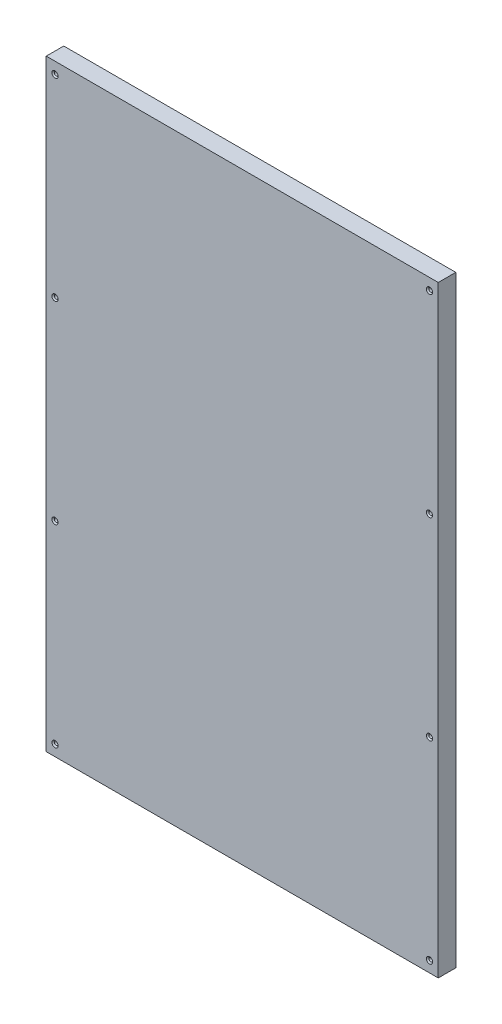
ISO-10303-21;
HEADER;
FILE_DESCRIPTION(('STEP AP214'),'2;1');
FILE_NAME('part.step','',(''),(''),'','','');
FILE_SCHEMA(('AUTOMOTIVE_DESIGN { 1 0 10303 214 1 1 1 1 }'));
ENDSEC;
DATA;
#1=APPLICATION_CONTEXT('core data for automotive mechanical design processes');
#2=APPLICATION_PROTOCOL_DEFINITION('international standard','automotive_design',2000,#1);
#3=PRODUCT_CONTEXT('',#1,'mechanical');
#4=PRODUCT('Part','Part','',(#3));
#5=PRODUCT_RELATED_PRODUCT_CATEGORY('part','',(#4));
#6=PRODUCT_DEFINITION_FORMATION('','',#4);
#7=PRODUCT_DEFINITION_CONTEXT('part definition',#1,'design');
#8=PRODUCT_DEFINITION('design','',#6,#7);
#9=PRODUCT_DEFINITION_SHAPE('','',#8);
#10=(LENGTH_UNIT() NAMED_UNIT(*) SI_UNIT(.MILLI.,.METRE.));
#11=(NAMED_UNIT(*) PLANE_ANGLE_UNIT() SI_UNIT($,.RADIAN.));
#12=(NAMED_UNIT(*) SI_UNIT($,.STERADIAN.) SOLID_ANGLE_UNIT());
#13=UNCERTAINTY_MEASURE_WITH_UNIT(LENGTH_MEASURE(1.E-05),#10,'distance_accuracy_value','');
#14=(GEOMETRIC_REPRESENTATION_CONTEXT(3) GLOBAL_UNCERTAINTY_ASSIGNED_CONTEXT((#13)) GLOBAL_UNIT_ASSIGNED_CONTEXT((#10,
#11,#12)) REPRESENTATION_CONTEXT('',''));
#15=CARTESIAN_POINT('',(0.,0.,0.));
#16=DIRECTION('',(0.,0.,1.));
#17=DIRECTION('',(1.,0.,0.));
#18=AXIS2_PLACEMENT_3D('',#15,#16,#17);
#19=CARTESIAN_POINT('',(0.,0.,16.));
#20=DIRECTION('',(0.,0.,-1.));
#21=DIRECTION('',(-1.,0.,0.));
#22=AXIS2_PLACEMENT_3D('',#19,#20,#21);
#23=PLANE('',#22);
#24=CARTESIAN_POINT('',(170.97,-265.,16.));
#25=DIRECTION('',(0.,0.,1.));
#26=DIRECTION('',(1.,0.,0.));
#27=AXIS2_PLACEMENT_3D('',#24,#25,#26);
#28=CIRCLE('',#27,2.85750000000001);
#29=CARTESIAN_POINT('',(173.8275,-265.,16.));
#30=VERTEX_POINT('',#29);
#31=EDGE_CURVE('E353',#30,#30,#28,.T.);
#32=ORIENTED_EDGE('',*,*,#31,.F.);
#33=EDGE_LOOP('',(#32));
#34=FACE_BOUND('',#33,.T.);
#35=CARTESIAN_POINT('',(-170.97,264.5,16.));
#36=DIRECTION('',(0.,0.,1.));
#37=DIRECTION('',(1.,0.,0.));
#38=AXIS2_PLACEMENT_3D('',#35,#36,#37);
#39=CIRCLE('',#38,2.85750000000001);
#40=CARTESIAN_POINT('',(-168.1125,264.5,16.));
#41=VERTEX_POINT('',#40);
#42=EDGE_CURVE('E362',#41,#41,#39,.T.);
#43=ORIENTED_EDGE('',*,*,#42,.F.);
#44=EDGE_LOOP('',(#43));
#45=FACE_BOUND('',#44,.T.);
#46=CARTESIAN_POINT('',(-170.97,-88.5,16.));
#47=DIRECTION('',(0.,0.,1.));
#48=DIRECTION('',(1.,0.,0.));
#49=AXIS2_PLACEMENT_3D('',#46,#47,#48);
#50=CIRCLE('',#49,2.85750000000001);
#51=CARTESIAN_POINT('',(-168.1125,-88.5,16.));
#52=VERTEX_POINT('',#51);
#53=EDGE_CURVE('E380',#52,#52,#50,.T.);
#54=ORIENTED_EDGE('',*,*,#53,.F.);
#55=EDGE_LOOP('',(#54));
#56=FACE_BOUND('',#55,.T.);
#57=CARTESIAN_POINT('',(-170.97,-265.,16.));
#58=DIRECTION('',(0.,0.,1.));
#59=DIRECTION('',(1.,0.,0.));
#60=AXIS2_PLACEMENT_3D('',#57,#58,#59);
#61=CIRCLE('',#60,2.85750000000001);
#62=CARTESIAN_POINT('',(-168.1125,-265.,16.));
#63=VERTEX_POINT('',#62);
#64=EDGE_CURVE('E389',#63,#63,#61,.T.);
#65=ORIENTED_EDGE('',*,*,#64,.F.);
#66=EDGE_LOOP('',(#65));
#67=FACE_BOUND('',#66,.T.);
#68=DIRECTION('',(1.,0.,0.));
#69=VECTOR('',#68,1.);
#70=CARTESIAN_POINT('',(-178.97,275.,16.));
#71=LINE('',#70,#69);
#72=CARTESIAN_POINT('',(-178.97,275.,16.));
#73=VERTEX_POINT('',#72);
#74=CARTESIAN_POINT('',(178.97,275.,16.));
#75=VERTEX_POINT('',#74);
#76=EDGE_CURVE('E94',#73,#75,#71,.T.);
#77=ORIENTED_EDGE('',*,*,#76,.F.);
#78=DIRECTION('',(0.,-1.,0.));
#79=VECTOR('',#78,1.);
#80=CARTESIAN_POINT('',(-178.97,275.,16.));
#81=LINE('',#80,#79);
#82=CARTESIAN_POINT('',(-178.97,-275.,16.));
#83=VERTEX_POINT('',#82);
#84=EDGE_CURVE('E84',#73,#83,#81,.T.);
#85=ORIENTED_EDGE('',*,*,#84,.T.);
#86=DIRECTION('',(1.,0.,0.));
#87=VECTOR('',#86,1.);
#88=CARTESIAN_POINT('',(-178.97,-275.,16.));
#89=LINE('',#88,#87);
#90=CARTESIAN_POINT('',(178.97,-275.,16.));
#91=VERTEX_POINT('',#90);
#92=EDGE_CURVE('E79',#83,#91,#89,.T.);
#93=ORIENTED_EDGE('',*,*,#92,.T.);
#94=DIRECTION('',(0.,-1.,0.));
#95=VECTOR('',#94,1.);
#96=CARTESIAN_POINT('',(178.97,275.,16.));
#97=LINE('',#96,#95);
#98=EDGE_CURVE('E83',#75,#91,#97,.T.);
#99=ORIENTED_EDGE('',*,*,#98,.F.);
#100=EDGE_LOOP('',(#77,#85,#93,#99));
#101=FACE_BOUND('',#100,.T.);
#102=CARTESIAN_POINT('',(-170.97,88.,16.));
#103=DIRECTION('',(0.,0.,1.));
#104=DIRECTION('',(1.,0.,0.));
#105=AXIS2_PLACEMENT_3D('',#102,#103,#104);
#106=CIRCLE('',#105,2.85750000000001);
#107=CARTESIAN_POINT('',(-168.1125,88.,16.));
#108=VERTEX_POINT('',#107);
#109=EDGE_CURVE('E371',#108,#108,#106,.T.);
#110=ORIENTED_EDGE('',*,*,#109,.F.);
#111=EDGE_LOOP('',(#110));
#112=FACE_BOUND('',#111,.T.);
#113=CARTESIAN_POINT('',(170.97,-88.5,16.));
#114=DIRECTION('',(0.,0.,1.));
#115=DIRECTION('',(1.,0.,0.));
#116=AXIS2_PLACEMENT_3D('',#113,#114,#115);
#117=CIRCLE('',#116,2.85750000000001);
#118=CARTESIAN_POINT('',(173.8275,-88.5,16.));
#119=VERTEX_POINT('',#118);
#120=EDGE_CURVE('E344',#119,#119,#117,.T.);
#121=ORIENTED_EDGE('',*,*,#120,.F.);
#122=EDGE_LOOP('',(#121));
#123=FACE_BOUND('',#122,.T.);
#124=CARTESIAN_POINT('',(170.97,88.,16.));
#125=DIRECTION('',(0.,0.,1.));
#126=DIRECTION('',(1.,0.,0.));
#127=AXIS2_PLACEMENT_3D('',#124,#125,#126);
#128=CIRCLE('',#127,2.85750000000001);
#129=CARTESIAN_POINT('',(173.8275,88.,16.));
#130=VERTEX_POINT('',#129);
#131=EDGE_CURVE('E335',#130,#130,#128,.T.);
#132=ORIENTED_EDGE('',*,*,#131,.F.);
#133=EDGE_LOOP('',(#132));
#134=FACE_BOUND('',#133,.T.);
#135=CARTESIAN_POINT('',(170.97,264.5,16.));
#136=DIRECTION('',(0.,0.,1.));
#137=DIRECTION('',(1.,0.,0.));
#138=AXIS2_PLACEMENT_3D('',#135,#136,#137);
#139=CIRCLE('',#138,2.85750000000001);
#140=CARTESIAN_POINT('',(173.8275,264.5,16.));
#141=VERTEX_POINT('',#140);
#142=EDGE_CURVE('E327',#141,#141,#139,.T.);
#143=ORIENTED_EDGE('',*,*,#142,.F.);
#144=EDGE_LOOP('',(#143));
#145=FACE_BOUND('',#144,.T.);
#146=ADVANCED_FACE('F33',(#34,#45,#56,#67,#101,#112,#123,#134,#145),#23,.F.);
#147=CARTESIAN_POINT('',(-178.97,275.,16.));
#148=DIRECTION('',(0.,1.,0.));
#149=DIRECTION('',(0.,0.,1.));
#150=AXIS2_PLACEMENT_3D('',#147,#148,#149);
#151=PLANE('',#150);
#152=DIRECTION('',(1.,0.,0.));
#153=VECTOR('',#152,1.);
#154=CARTESIAN_POINT('',(-178.97,275.,0.));
#155=LINE('',#154,#153);
#156=CARTESIAN_POINT('',(-178.97,275.,0.));
#157=VERTEX_POINT('',#156);
#158=CARTESIAN_POINT('',(178.97,275.,0.));
#159=VERTEX_POINT('',#158);
#160=EDGE_CURVE('E100',#157,#159,#155,.T.);
#161=ORIENTED_EDGE('',*,*,#160,.F.);
#162=DIRECTION('',(0.,0.,-1.));
#163=VECTOR('',#162,1.);
#164=CARTESIAN_POINT('',(-178.97,275.,16.));
#165=LINE('',#164,#163);
#166=EDGE_CURVE('E11',#73,#157,#165,.T.);
#167=ORIENTED_EDGE('',*,*,#166,.F.);
#168=ORIENTED_EDGE('',*,*,#76,.T.);
#169=DIRECTION('',(0.,0.,-1.));
#170=VECTOR('',#169,1.);
#171=CARTESIAN_POINT('',(178.97,275.,16.));
#172=LINE('',#171,#170);
#173=EDGE_CURVE('E37',#75,#159,#172,.T.);
#174=ORIENTED_EDGE('',*,*,#173,.T.);
#175=EDGE_LOOP('',(#161,#167,#168,#174));
#176=FACE_BOUND('',#175,.T.);
#177=ADVANCED_FACE('F35',(#176),#151,.T.);
#178=CARTESIAN_POINT('',(-178.97,275.,16.));
#179=DIRECTION('',(1.,0.,0.));
#180=DIRECTION('',(0.,0.,-1.));
#181=AXIS2_PLACEMENT_3D('',#178,#179,#180);
#182=PLANE('',#181);
#183=DIRECTION('',(0.,-1.,0.));
#184=VECTOR('',#183,1.);
#185=CARTESIAN_POINT('',(-178.97,275.,0.));
#186=LINE('',#185,#184);
#187=CARTESIAN_POINT('',(-178.97,-275.,0.));
#188=VERTEX_POINT('',#187);
#189=EDGE_CURVE('E67',#157,#188,#186,.T.);
#190=ORIENTED_EDGE('',*,*,#189,.T.);
#191=DIRECTION('',(0.,0.,-1.));
#192=VECTOR('',#191,1.);
#193=CARTESIAN_POINT('',(-178.97,-275.,16.));
#194=LINE('',#193,#192);
#195=EDGE_CURVE('E43',#83,#188,#194,.T.);
#196=ORIENTED_EDGE('',*,*,#195,.F.);
#197=ORIENTED_EDGE('',*,*,#84,.F.);
#198=ORIENTED_EDGE('',*,*,#166,.T.);
#199=EDGE_LOOP('',(#190,#196,#197,#198));
#200=FACE_BOUND('',#199,.T.);
#201=ADVANCED_FACE('F111',(#200),#182,.F.);
#202=CARTESIAN_POINT('',(-178.97,-275.,16.));
#203=DIRECTION('',(0.,1.,0.));
#204=DIRECTION('',(0.,0.,1.));
#205=AXIS2_PLACEMENT_3D('',#202,#203,#204);
#206=PLANE('',#205);
#207=DIRECTION('',(1.,0.,0.));
#208=VECTOR('',#207,1.);
#209=CARTESIAN_POINT('',(-178.97,-275.,0.));
#210=LINE('',#209,#208);
#211=CARTESIAN_POINT('',(178.97,-275.,0.));
#212=VERTEX_POINT('',#211);
#213=EDGE_CURVE('E91',#188,#212,#210,.T.);
#214=ORIENTED_EDGE('',*,*,#213,.T.);
#215=DIRECTION('',(0.,0.,-1.));
#216=VECTOR('',#215,1.);
#217=CARTESIAN_POINT('',(178.97,-275.,16.));
#218=LINE('',#217,#216);
#219=EDGE_CURVE('E88',#91,#212,#218,.T.);
#220=ORIENTED_EDGE('',*,*,#219,.F.);
#221=ORIENTED_EDGE('',*,*,#92,.F.);
#222=ORIENTED_EDGE('',*,*,#195,.T.);
#223=EDGE_LOOP('',(#214,#220,#221,#222));
#224=FACE_BOUND('',#223,.T.);
#225=ADVANCED_FACE('F89',(#224),#206,.F.);
#226=CARTESIAN_POINT('',(178.97,275.,16.));
#227=DIRECTION('',(1.,0.,0.));
#228=DIRECTION('',(0.,0.,-1.));
#229=AXIS2_PLACEMENT_3D('',#226,#227,#228);
#230=PLANE('',#229);
#231=DIRECTION('',(0.,-1.,0.));
#232=VECTOR('',#231,1.);
#233=CARTESIAN_POINT('',(178.97,275.,0.));
#234=LINE('',#233,#232);
#235=EDGE_CURVE('E103',#159,#212,#234,.T.);
#236=ORIENTED_EDGE('',*,*,#235,.F.);
#237=ORIENTED_EDGE('',*,*,#173,.F.);
#238=ORIENTED_EDGE('',*,*,#98,.T.);
#239=ORIENTED_EDGE('',*,*,#219,.T.);
#240=EDGE_LOOP('',(#236,#237,#238,#239));
#241=FACE_BOUND('',#240,.T.);
#242=ADVANCED_FACE('F93',(#241),#230,.T.);
#243=CARTESIAN_POINT('',(0.,0.,0.));
#244=DIRECTION('',(0.,0.,-1.));
#245=DIRECTION('',(-1.,0.,0.));
#246=AXIS2_PLACEMENT_3D('',#243,#244,#245);
#247=PLANE('',#246);
#248=CARTESIAN_POINT('',(170.97,264.5,0.));
#249=DIRECTION('',(0.,0.,-1.));
#250=DIRECTION('',(-1.,0.,0.));
#251=AXIS2_PLACEMENT_3D('',#248,#249,#250);
#252=CIRCLE('',#251,1.63194999999999);
#253=CARTESIAN_POINT('',(169.33805,264.5,0.));
#254=VERTEX_POINT('',#253);
#255=EDGE_CURVE('E330',#254,#254,#252,.T.);
#256=ORIENTED_EDGE('',*,*,#255,.F.);
#257=EDGE_LOOP('',(#256));
#258=FACE_BOUND('',#257,.T.);
#259=CARTESIAN_POINT('',(170.97,88.,0.));
#260=DIRECTION('',(0.,0.,-1.));
#261=DIRECTION('',(-1.,0.,0.));
#262=AXIS2_PLACEMENT_3D('',#259,#260,#261);
#263=CIRCLE('',#262,1.63194999999999);
#264=CARTESIAN_POINT('',(169.33805,88.,0.));
#265=VERTEX_POINT('',#264);
#266=EDGE_CURVE('E341',#265,#265,#263,.T.);
#267=ORIENTED_EDGE('',*,*,#266,.F.);
#268=EDGE_LOOP('',(#267));
#269=FACE_BOUND('',#268,.T.);
#270=CARTESIAN_POINT('',(170.97,-88.5,0.));
#271=DIRECTION('',(0.,0.,-1.));
#272=DIRECTION('',(-1.,0.,0.));
#273=AXIS2_PLACEMENT_3D('',#270,#271,#272);
#274=CIRCLE('',#273,1.63194999999999);
#275=CARTESIAN_POINT('',(169.33805,-88.5,0.));
#276=VERTEX_POINT('',#275);
#277=EDGE_CURVE('E350',#276,#276,#274,.T.);
#278=ORIENTED_EDGE('',*,*,#277,.F.);
#279=EDGE_LOOP('',(#278));
#280=FACE_BOUND('',#279,.T.);
#281=CARTESIAN_POINT('',(170.97,-265.,0.));
#282=DIRECTION('',(0.,0.,-1.));
#283=DIRECTION('',(-1.,0.,0.));
#284=AXIS2_PLACEMENT_3D('',#281,#282,#283);
#285=CIRCLE('',#284,1.63194999999999);
#286=CARTESIAN_POINT('',(169.33805,-265.,0.));
#287=VERTEX_POINT('',#286);
#288=EDGE_CURVE('E359',#287,#287,#285,.T.);
#289=ORIENTED_EDGE('',*,*,#288,.F.);
#290=EDGE_LOOP('',(#289));
#291=FACE_BOUND('',#290,.T.);
#292=CARTESIAN_POINT('',(-170.97,264.5,0.));
#293=DIRECTION('',(0.,0.,-1.));
#294=DIRECTION('',(-1.,0.,0.));
#295=AXIS2_PLACEMENT_3D('',#292,#293,#294);
#296=CIRCLE('',#295,1.63194999999999);
#297=CARTESIAN_POINT('',(-172.60195,264.5,0.));
#298=VERTEX_POINT('',#297);
#299=EDGE_CURVE('E368',#298,#298,#296,.T.);
#300=ORIENTED_EDGE('',*,*,#299,.F.);
#301=EDGE_LOOP('',(#300));
#302=FACE_BOUND('',#301,.T.);
#303=CARTESIAN_POINT('',(-170.97,88.,0.));
#304=DIRECTION('',(0.,0.,-1.));
#305=DIRECTION('',(-1.,0.,0.));
#306=AXIS2_PLACEMENT_3D('',#303,#304,#305);
#307=CIRCLE('',#306,1.63194999999999);
#308=CARTESIAN_POINT('',(-172.60195,88.,0.));
#309=VERTEX_POINT('',#308);
#310=EDGE_CURVE('E377',#309,#309,#307,.T.);
#311=ORIENTED_EDGE('',*,*,#310,.F.);
#312=EDGE_LOOP('',(#311));
#313=FACE_BOUND('',#312,.T.);
#314=CARTESIAN_POINT('',(-170.97,-88.5,0.));
#315=DIRECTION('',(0.,0.,-1.));
#316=DIRECTION('',(-1.,0.,0.));
#317=AXIS2_PLACEMENT_3D('',#314,#315,#316);
#318=CIRCLE('',#317,1.63194999999999);
#319=CARTESIAN_POINT('',(-172.60195,-88.5,0.));
#320=VERTEX_POINT('',#319);
#321=EDGE_CURVE('E386',#320,#320,#318,.T.);
#322=ORIENTED_EDGE('',*,*,#321,.F.);
#323=EDGE_LOOP('',(#322));
#324=FACE_BOUND('',#323,.T.);
#325=CARTESIAN_POINT('',(-170.97,-265.,0.));
#326=DIRECTION('',(0.,0.,-1.));
#327=DIRECTION('',(-1.,0.,0.));
#328=AXIS2_PLACEMENT_3D('',#325,#326,#327);
#329=CIRCLE('',#328,1.63194999999999);
#330=CARTESIAN_POINT('',(-172.60195,-265.,0.));
#331=VERTEX_POINT('',#330);
#332=EDGE_CURVE('E104',#331,#331,#329,.T.);
#333=ORIENTED_EDGE('',*,*,#332,.F.);
#334=EDGE_LOOP('',(#333));
#335=FACE_BOUND('',#334,.T.);
#336=ORIENTED_EDGE('',*,*,#160,.T.);
#337=ORIENTED_EDGE('',*,*,#235,.T.);
#338=ORIENTED_EDGE('',*,*,#213,.F.);
#339=ORIENTED_EDGE('',*,*,#189,.F.);
#340=EDGE_LOOP('',(#336,#337,#338,#339));
#341=FACE_BOUND('',#340,.T.);
#342=ADVANCED_FACE('F109',(#258,#269,#280,#291,#302,#313,#324,#335,#341),#247,.T.);
#343=CARTESIAN_POINT('',(-170.97,-265.,16.));
#344=DIRECTION('',(0.,0.,1.));
#345=DIRECTION('',(1.,0.,0.));
#346=AXIS2_PLACEMENT_3D('',#343,#344,#345);
#347=CYLINDRICAL_SURFACE('',#346,1.63194999999999);
#348=CARTESIAN_POINT('',(-170.97,-265.,14.9716414470107));
#349=DIRECTION('',(0.,0.,1.));
#350=DIRECTION('',(1.,0.,0.));
#351=AXIS2_PLACEMENT_3D('',#348,#349,#350);
#352=CIRCLE('',#351,1.63194999999999);
#353=CARTESIAN_POINT('',(-169.33805,-265.,14.9716414470107));
#354=VERTEX_POINT('',#353);
#355=EDGE_CURVE('E392',#354,#354,#352,.T.);
#356=ORIENTED_EDGE('',*,*,#355,.T.);
#357=EDGE_LOOP('',(#356));
#358=FACE_BOUND('',#357,.T.);
#359=ORIENTED_EDGE('',*,*,#332,.T.);
#360=EDGE_LOOP('',(#359));
#361=FACE_BOUND('',#360,.T.);
#362=ADVANCED_FACE('F125',(#358,#361),#347,.F.);
#363=CARTESIAN_POINT('',(-170.97,-265.,16.));
#364=DIRECTION('',(0.,0.,1.));
#365=DIRECTION('',(1.,0.,0.));
#366=AXIS2_PLACEMENT_3D('',#363,#364,#365);
#367=CONICAL_SURFACE('',#366,2.85750000000001,0.87266462599717);
#368=ORIENTED_EDGE('',*,*,#355,.F.);
#369=EDGE_LOOP('',(#368));
#370=FACE_BOUND('',#369,.T.);
#371=ORIENTED_EDGE('',*,*,#64,.T.);
#372=EDGE_LOOP('',(#371));
#373=FACE_BOUND('',#372,.T.);
#374=ADVANCED_FACE('F147',(#370,#373),#367,.F.);
#375=CARTESIAN_POINT('',(-170.97,-88.5,16.));
#376=DIRECTION('',(0.,0.,1.));
#377=DIRECTION('',(1.,0.,0.));
#378=AXIS2_PLACEMENT_3D('',#375,#376,#377);
#379=CYLINDRICAL_SURFACE('',#378,1.63194999999999);
#380=CARTESIAN_POINT('',(-170.97,-88.5,14.9716414470107));
#381=DIRECTION('',(0.,0.,1.));
#382=DIRECTION('',(1.,0.,0.));
#383=AXIS2_PLACEMENT_3D('',#380,#381,#382);
#384=CIRCLE('',#383,1.63194999999999);
#385=CARTESIAN_POINT('',(-169.33805,-88.5,14.9716414470107));
#386=VERTEX_POINT('',#385);
#387=EDGE_CURVE('E383',#386,#386,#384,.T.);
#388=ORIENTED_EDGE('',*,*,#387,.T.);
#389=EDGE_LOOP('',(#388));
#390=FACE_BOUND('',#389,.T.);
#391=ORIENTED_EDGE('',*,*,#321,.T.);
#392=EDGE_LOOP('',(#391));
#393=FACE_BOUND('',#392,.T.);
#394=ADVANCED_FACE('F154',(#390,#393),#379,.F.);
#395=CARTESIAN_POINT('',(-170.97,-88.5,16.));
#396=DIRECTION('',(0.,0.,1.));
#397=DIRECTION('',(1.,0.,0.));
#398=AXIS2_PLACEMENT_3D('',#395,#396,#397);
#399=CONICAL_SURFACE('',#398,2.85750000000001,0.87266462599717);
#400=ORIENTED_EDGE('',*,*,#387,.F.);
#401=EDGE_LOOP('',(#400));
#402=FACE_BOUND('',#401,.T.);
#403=ORIENTED_EDGE('',*,*,#53,.T.);
#404=EDGE_LOOP('',(#403));
#405=FACE_BOUND('',#404,.T.);
#406=ADVANCED_FACE('F161',(#402,#405),#399,.F.);
#407=CARTESIAN_POINT('',(-170.97,88.,16.));
#408=DIRECTION('',(0.,0.,1.));
#409=DIRECTION('',(1.,0.,0.));
#410=AXIS2_PLACEMENT_3D('',#407,#408,#409);
#411=CYLINDRICAL_SURFACE('',#410,1.63194999999999);
#412=CARTESIAN_POINT('',(-170.97,88.,14.9716414470107));
#413=DIRECTION('',(0.,0.,1.));
#414=DIRECTION('',(1.,0.,0.));
#415=AXIS2_PLACEMENT_3D('',#412,#413,#414);
#416=CIRCLE('',#415,1.63194999999999);
#417=CARTESIAN_POINT('',(-169.33805,88.,14.9716414470107));
#418=VERTEX_POINT('',#417);
#419=EDGE_CURVE('E374',#418,#418,#416,.T.);
#420=ORIENTED_EDGE('',*,*,#419,.T.);
#421=EDGE_LOOP('',(#420));
#422=FACE_BOUND('',#421,.T.);
#423=ORIENTED_EDGE('',*,*,#310,.T.);
#424=EDGE_LOOP('',(#423));
#425=FACE_BOUND('',#424,.T.);
#426=ADVANCED_FACE('F169',(#422,#425),#411,.F.);
#427=CARTESIAN_POINT('',(-170.97,88.,16.));
#428=DIRECTION('',(0.,0.,1.));
#429=DIRECTION('',(1.,0.,0.));
#430=AXIS2_PLACEMENT_3D('',#427,#428,#429);
#431=CONICAL_SURFACE('',#430,2.85750000000001,0.87266462599717);
#432=ORIENTED_EDGE('',*,*,#419,.F.);
#433=EDGE_LOOP('',(#432));
#434=FACE_BOUND('',#433,.T.);
#435=ORIENTED_EDGE('',*,*,#109,.T.);
#436=EDGE_LOOP('',(#435));
#437=FACE_BOUND('',#436,.T.);
#438=ADVANCED_FACE('F177',(#434,#437),#431,.F.);
#439=CARTESIAN_POINT('',(-170.97,264.5,16.));
#440=DIRECTION('',(0.,0.,1.));
#441=DIRECTION('',(1.,0.,0.));
#442=AXIS2_PLACEMENT_3D('',#439,#440,#441);
#443=CYLINDRICAL_SURFACE('',#442,1.63194999999999);
#444=CARTESIAN_POINT('',(-170.97,264.5,14.9716414470107));
#445=DIRECTION('',(0.,0.,1.));
#446=DIRECTION('',(1.,0.,0.));
#447=AXIS2_PLACEMENT_3D('',#444,#445,#446);
#448=CIRCLE('',#447,1.63194999999999);
#449=CARTESIAN_POINT('',(-169.33805,264.5,14.9716414470107));
#450=VERTEX_POINT('',#449);
#451=EDGE_CURVE('E365',#450,#450,#448,.T.);
#452=ORIENTED_EDGE('',*,*,#451,.T.);
#453=EDGE_LOOP('',(#452));
#454=FACE_BOUND('',#453,.T.);
#455=ORIENTED_EDGE('',*,*,#299,.T.);
#456=EDGE_LOOP('',(#455));
#457=FACE_BOUND('',#456,.T.);
#458=ADVANCED_FACE('F185',(#454,#457),#443,.F.);
#459=CARTESIAN_POINT('',(-170.97,264.5,16.));
#460=DIRECTION('',(0.,0.,1.));
#461=DIRECTION('',(1.,0.,0.));
#462=AXIS2_PLACEMENT_3D('',#459,#460,#461);
#463=CONICAL_SURFACE('',#462,2.85750000000001,0.87266462599717);
#464=ORIENTED_EDGE('',*,*,#451,.F.);
#465=EDGE_LOOP('',(#464));
#466=FACE_BOUND('',#465,.T.);
#467=ORIENTED_EDGE('',*,*,#42,.T.);
#468=EDGE_LOOP('',(#467));
#469=FACE_BOUND('',#468,.T.);
#470=ADVANCED_FACE('F193',(#466,#469),#463,.F.);
#471=CARTESIAN_POINT('',(170.97,-265.,16.));
#472=DIRECTION('',(0.,0.,1.));
#473=DIRECTION('',(1.,0.,0.));
#474=AXIS2_PLACEMENT_3D('',#471,#472,#473);
#475=CYLINDRICAL_SURFACE('',#474,1.63194999999999);
#476=CARTESIAN_POINT('',(170.97,-265.,14.9716414470107));
#477=DIRECTION('',(0.,0.,1.));
#478=DIRECTION('',(1.,0.,0.));
#479=AXIS2_PLACEMENT_3D('',#476,#477,#478);
#480=CIRCLE('',#479,1.63194999999999);
#481=CARTESIAN_POINT('',(172.60195,-265.,14.9716414470107));
#482=VERTEX_POINT('',#481);
#483=EDGE_CURVE('E356',#482,#482,#480,.T.);
#484=ORIENTED_EDGE('',*,*,#483,.T.);
#485=EDGE_LOOP('',(#484));
#486=FACE_BOUND('',#485,.T.);
#487=ORIENTED_EDGE('',*,*,#288,.T.);
#488=EDGE_LOOP('',(#487));
#489=FACE_BOUND('',#488,.T.);
#490=ADVANCED_FACE('F201',(#486,#489),#475,.F.);
#491=CARTESIAN_POINT('',(170.97,-265.,16.));
#492=DIRECTION('',(0.,0.,1.));
#493=DIRECTION('',(1.,0.,0.));
#494=AXIS2_PLACEMENT_3D('',#491,#492,#493);
#495=CONICAL_SURFACE('',#494,2.85750000000001,0.87266462599717);
#496=ORIENTED_EDGE('',*,*,#483,.F.);
#497=EDGE_LOOP('',(#496));
#498=FACE_BOUND('',#497,.T.);
#499=ORIENTED_EDGE('',*,*,#31,.T.);
#500=EDGE_LOOP('',(#499));
#501=FACE_BOUND('',#500,.T.);
#502=ADVANCED_FACE('F208',(#498,#501),#495,.F.);
#503=CARTESIAN_POINT('',(170.97,-88.5,16.));
#504=DIRECTION('',(0.,0.,1.));
#505=DIRECTION('',(1.,0.,0.));
#506=AXIS2_PLACEMENT_3D('',#503,#504,#505);
#507=CYLINDRICAL_SURFACE('',#506,1.63194999999999);
#508=CARTESIAN_POINT('',(170.97,-88.5,14.9716414470107));
#509=DIRECTION('',(0.,0.,1.));
#510=DIRECTION('',(1.,0.,0.));
#511=AXIS2_PLACEMENT_3D('',#508,#509,#510);
#512=CIRCLE('',#511,1.63194999999999);
#513=CARTESIAN_POINT('',(172.60195,-88.5,14.9716414470107));
#514=VERTEX_POINT('',#513);
#515=EDGE_CURVE('E347',#514,#514,#512,.T.);
#516=ORIENTED_EDGE('',*,*,#515,.T.);
#517=EDGE_LOOP('',(#516));
#518=FACE_BOUND('',#517,.T.);
#519=ORIENTED_EDGE('',*,*,#277,.T.);
#520=EDGE_LOOP('',(#519));
#521=FACE_BOUND('',#520,.T.);
#522=ADVANCED_FACE('F216',(#518,#521),#507,.F.);
#523=CARTESIAN_POINT('',(170.97,-88.5,16.));
#524=DIRECTION('',(0.,0.,1.));
#525=DIRECTION('',(1.,0.,0.));
#526=AXIS2_PLACEMENT_3D('',#523,#524,#525);
#527=CONICAL_SURFACE('',#526,2.85750000000001,0.87266462599717);
#528=ORIENTED_EDGE('',*,*,#515,.F.);
#529=EDGE_LOOP('',(#528));
#530=FACE_BOUND('',#529,.T.);
#531=ORIENTED_EDGE('',*,*,#120,.T.);
#532=EDGE_LOOP('',(#531));
#533=FACE_BOUND('',#532,.T.);
#534=ADVANCED_FACE('F224',(#530,#533),#527,.F.);
#535=CARTESIAN_POINT('',(170.97,88.,16.));
#536=DIRECTION('',(0.,0.,1.));
#537=DIRECTION('',(1.,0.,0.));
#538=AXIS2_PLACEMENT_3D('',#535,#536,#537);
#539=CYLINDRICAL_SURFACE('',#538,1.63194999999999);
#540=CARTESIAN_POINT('',(170.97,88.,14.9716414470107));
#541=DIRECTION('',(0.,0.,1.));
#542=DIRECTION('',(1.,0.,0.));
#543=AXIS2_PLACEMENT_3D('',#540,#541,#542);
#544=CIRCLE('',#543,1.63194999999999);
#545=CARTESIAN_POINT('',(172.60195,88.,14.9716414470107));
#546=VERTEX_POINT('',#545);
#547=EDGE_CURVE('E338',#546,#546,#544,.T.);
#548=ORIENTED_EDGE('',*,*,#547,.T.);
#549=EDGE_LOOP('',(#548));
#550=FACE_BOUND('',#549,.T.);
#551=ORIENTED_EDGE('',*,*,#266,.T.);
#552=EDGE_LOOP('',(#551));
#553=FACE_BOUND('',#552,.T.);
#554=ADVANCED_FACE('F232',(#550,#553),#539,.F.);
#555=CARTESIAN_POINT('',(170.97,88.,16.));
#556=DIRECTION('',(0.,0.,1.));
#557=DIRECTION('',(1.,0.,0.));
#558=AXIS2_PLACEMENT_3D('',#555,#556,#557);
#559=CONICAL_SURFACE('',#558,2.85750000000001,0.87266462599717);
#560=ORIENTED_EDGE('',*,*,#547,.F.);
#561=EDGE_LOOP('',(#560));
#562=FACE_BOUND('',#561,.T.);
#563=ORIENTED_EDGE('',*,*,#131,.T.);
#564=EDGE_LOOP('',(#563));
#565=FACE_BOUND('',#564,.T.);
#566=ADVANCED_FACE('F240',(#562,#565),#559,.F.);
#567=CARTESIAN_POINT('',(170.97,264.5,16.));
#568=DIRECTION('',(0.,0.,1.));
#569=DIRECTION('',(1.,0.,0.));
#570=AXIS2_PLACEMENT_3D('',#567,#568,#569);
#571=CYLINDRICAL_SURFACE('',#570,1.63194999999999);
#572=CARTESIAN_POINT('',(170.97,264.5,14.9716414470107));
#573=DIRECTION('',(0.,0.,1.));
#574=DIRECTION('',(1.,0.,0.));
#575=AXIS2_PLACEMENT_3D('',#572,#573,#574);
#576=CIRCLE('',#575,1.63194999999999);
#577=CARTESIAN_POINT('',(172.60195,264.5,14.9716414470107));
#578=VERTEX_POINT('',#577);
#579=EDGE_CURVE('E324',#578,#578,#576,.T.);
#580=ORIENTED_EDGE('',*,*,#579,.T.);
#581=EDGE_LOOP('',(#580));
#582=FACE_BOUND('',#581,.T.);
#583=ORIENTED_EDGE('',*,*,#255,.T.);
#584=EDGE_LOOP('',(#583));
#585=FACE_BOUND('',#584,.T.);
#586=ADVANCED_FACE('F248',(#582,#585),#571,.F.);
#587=CARTESIAN_POINT('',(170.97,264.5,16.));
#588=DIRECTION('',(0.,0.,1.));
#589=DIRECTION('',(1.,0.,0.));
#590=AXIS2_PLACEMENT_3D('',#587,#588,#589);
#591=CONICAL_SURFACE('',#590,2.85750000000001,0.87266462599717);
#592=ORIENTED_EDGE('',*,*,#579,.F.);
#593=EDGE_LOOP('',(#592));
#594=FACE_BOUND('',#593,.T.);
#595=ORIENTED_EDGE('',*,*,#142,.T.);
#596=EDGE_LOOP('',(#595));
#597=FACE_BOUND('',#596,.T.);
#598=ADVANCED_FACE('F256',(#594,#597),#591,.F.);
#599=CLOSED_SHELL('',(#146,#177,#201,#225,#242,#342,#362,#374,#394,#406,#426,#438,#458,#470,
#490,#502,#522,#534,#554,#566,#586,#598));
#600=MANIFOLD_SOLID_BREP('B2',#599);
#601=ADVANCED_BREP_SHAPE_REPRESENTATION('',(#18,#600),#14);
#602=SHAPE_DEFINITION_REPRESENTATION(#9,#601);
ENDSEC;
END-ISO-10303-21;
